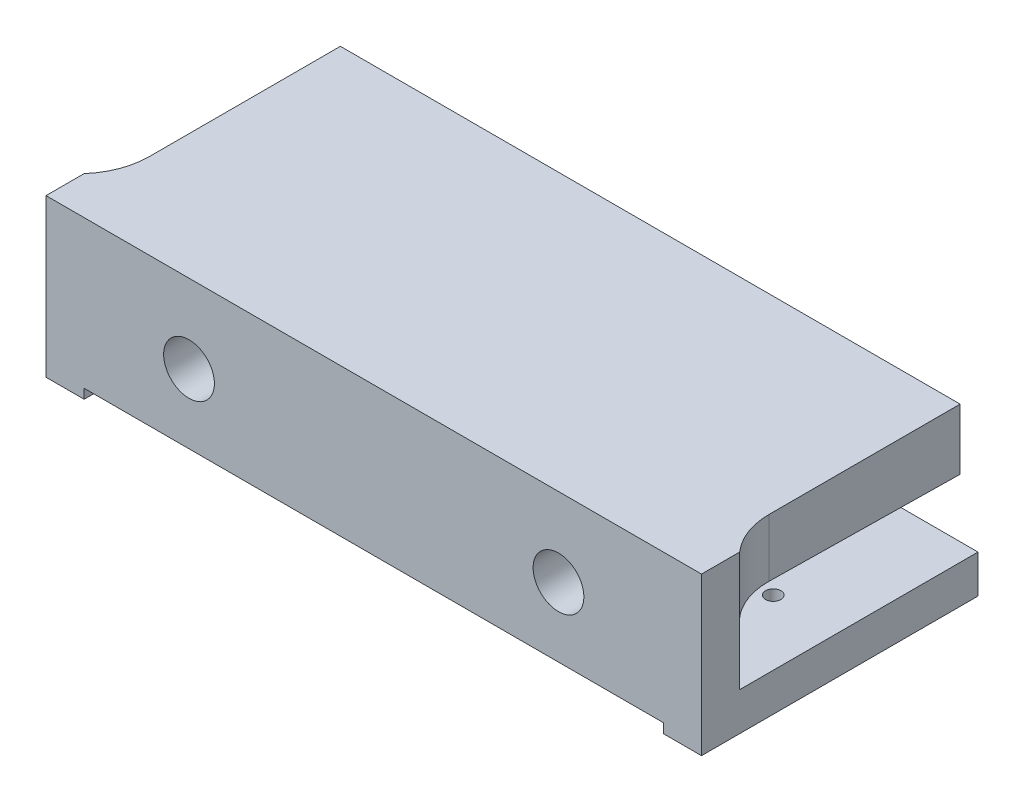
ISO-10303-21;
HEADER;
FILE_DESCRIPTION(('STEP AP214'),'2;1');
FILE_NAME('part.step','',(''),(''),'','','');
FILE_SCHEMA(('AUTOMOTIVE_DESIGN { 1 0 10303 214 1 1 1 1 }'));
ENDSEC;
DATA;
#1=APPLICATION_CONTEXT('core data for automotive mechanical design processes');
#2=APPLICATION_PROTOCOL_DEFINITION('international standard','automotive_design',2000,#1);
#3=PRODUCT_CONTEXT('',#1,'mechanical');
#4=PRODUCT('Part','Part','',(#3));
#5=PRODUCT_RELATED_PRODUCT_CATEGORY('part','',(#4));
#6=PRODUCT_DEFINITION_FORMATION('','',#4);
#7=PRODUCT_DEFINITION_CONTEXT('part definition',#1,'design');
#8=PRODUCT_DEFINITION('design','',#6,#7);
#9=PRODUCT_DEFINITION_SHAPE('','',#8);
#10=(LENGTH_UNIT() NAMED_UNIT(*) SI_UNIT(.MILLI.,.METRE.));
#11=(NAMED_UNIT(*) PLANE_ANGLE_UNIT() SI_UNIT($,.RADIAN.));
#12=(NAMED_UNIT(*) SI_UNIT($,.STERADIAN.) SOLID_ANGLE_UNIT());
#13=UNCERTAINTY_MEASURE_WITH_UNIT(LENGTH_MEASURE(1.E-05),#10,'distance_accuracy_value','');
#14=(GEOMETRIC_REPRESENTATION_CONTEXT(3) GLOBAL_UNCERTAINTY_ASSIGNED_CONTEXT((#13)) GLOBAL_UNIT_ASSIGNED_CONTEXT((#10,
#11,#12)) REPRESENTATION_CONTEXT('',''));
#15=CARTESIAN_POINT('',(0.,0.,0.));
#16=DIRECTION('',(0.,0.,1.));
#17=DIRECTION('',(1.,0.,0.));
#18=AXIS2_PLACEMENT_3D('',#15,#16,#17);
#19=CARTESIAN_POINT('',(0.,0.,-14.732));
#20=DIRECTION('',(0.,0.,1.));
#21=DIRECTION('',(1.,0.,0.));
#22=AXIS2_PLACEMENT_3D('',#19,#20,#21);
#23=PLANE('',#22);
#24=DIRECTION('',(0.,-1.,0.));
#25=VECTOR('',#24,1.);
#26=CARTESIAN_POINT('',(33.02,0.,-14.732));
#27=LINE('',#26,#25);
#28=CARTESIAN_POINT('',(33.02,16.764,-14.732));
#29=VERTEX_POINT('',#28);
#30=CARTESIAN_POINT('',(33.02,10.287,-14.732));
#31=VERTEX_POINT('',#30);
#32=EDGE_CURVE('E297',#29,#31,#27,.T.);
#33=ORIENTED_EDGE('',*,*,#32,.T.);
#34=DIRECTION('',(-1.,0.,0.));
#35=VECTOR('',#34,1.);
#36=CARTESIAN_POINT('',(34.925,10.287,-14.732));
#37=LINE('',#36,#35);
#38=CARTESIAN_POINT('',(-33.02,10.287,-14.732));
#39=VERTEX_POINT('',#38);
#40=EDGE_CURVE('E190',#31,#39,#37,.T.);
#41=ORIENTED_EDGE('',*,*,#40,.T.);
#42=DIRECTION('',(0.,-1.,0.));
#43=VECTOR('',#42,1.);
#44=CARTESIAN_POINT('',(-33.02,0.,-14.732));
#45=LINE('',#44,#43);
#46=CARTESIAN_POINT('',(-33.02,16.764,-14.732));
#47=VERTEX_POINT('',#46);
#48=EDGE_CURVE('E293',#47,#39,#45,.T.);
#49=ORIENTED_EDGE('',*,*,#48,.F.);
#50=DIRECTION('',(1.,0.,0.));
#51=VECTOR('',#50,1.);
#52=CARTESIAN_POINT('',(34.925,16.764,-14.732));
#53=LINE('',#52,#51);
#54=EDGE_CURVE('E205',#47,#29,#53,.T.);
#55=ORIENTED_EDGE('',*,*,#54,.T.);
#56=EDGE_LOOP('',(#33,#41,#49,#55));
#57=FACE_BOUND('',#56,.T.);
#58=ADVANCED_FACE('F37',(#57),#23,.F.);
#59=CARTESIAN_POINT('',(34.925,10.287,-14.732));
#60=DIRECTION('',(0.,0.999887518980816,-0.0149983127847122));
#61=DIRECTION('',(0.,0.0149983127847122,0.999887518980816));
#62=AXIS2_PLACEMENT_3D('',#59,#60,#61);
#63=PLANE('',#62);
#64=DIRECTION('',(0.,-0.0149983127847122,-0.999887518980816));
#65=VECTOR('',#64,1.);
#66=CARTESIAN_POINT('',(33.02,10.287,-14.732));
#67=LINE('',#66,#65);
#68=CARTESIAN_POINT('',(33.02,10.5923976562863,5.62784375242197));
#69=VERTEX_POINT('',#68);
#70=EDGE_CURVE('E179',#69,#31,#67,.T.);
#71=ORIENTED_EDGE('',*,*,#70,.F.);
#72=CARTESIAN_POINT('',(40.64,10.5923976562863,5.62784375242197));
#73=DIRECTION('',(0.,0.999887518980816,-0.0149983127847122));
#74=DIRECTION('',(0.,-0.0149983127847122,-0.999887518980816));
#75=AXIS2_PLACEMENT_3D('',#72,#73,#74);
#76=ELLIPSE('',#75,7.62085720178511,7.62);
#77=CARTESIAN_POINT('',(34.925,10.668,10.668));
#78=VERTEX_POINT('',#77);
#79=EDGE_CURVE('E45',#69,#78,#76,.T.);
#80=ORIENTED_EDGE('',*,*,#79,.T.);
#81=DIRECTION('',(-1.,0.,0.));
#82=VECTOR('',#81,1.);
#83=CARTESIAN_POINT('',(34.925,10.668,10.668));
#84=LINE('',#83,#82);
#85=CARTESIAN_POINT('',(21.131295270683,10.668,10.668));
#86=VERTEX_POINT('',#85);
#87=EDGE_CURVE('E186',#78,#86,#84,.T.);
#88=ORIENTED_EDGE('',*,*,#87,.T.);
#89=CARTESIAN_POINT('',(18.238704729317,10.668,10.668));
#90=VERTEX_POINT('',#89);
#91=EDGE_CURVE('E275',#86,#90,#84,.T.);
#92=ORIENTED_EDGE('',*,*,#91,.T.);
#93=CARTESIAN_POINT('',(-18.238704729317,10.668,10.668));
#94=VERTEX_POINT('',#93);
#95=EDGE_CURVE('E306',#90,#94,#84,.T.);
#96=ORIENTED_EDGE('',*,*,#95,.T.);
#97=CARTESIAN_POINT('',(-21.131295270683,10.668,10.668));
#98=VERTEX_POINT('',#97);
#99=EDGE_CURVE('E313',#94,#98,#84,.T.);
#100=ORIENTED_EDGE('',*,*,#99,.T.);
#101=CARTESIAN_POINT('',(-34.925,10.668,10.668));
#102=VERTEX_POINT('',#101);
#103=EDGE_CURVE('E276',#98,#102,#84,.T.);
#104=ORIENTED_EDGE('',*,*,#103,.T.);
#105=CARTESIAN_POINT('',(-40.64,10.5923976562863,5.62784375242197));
#106=DIRECTION('',(0.,0.999887518980816,-0.0149983127847122));
#107=DIRECTION('',(0.,0.0149983127847122,0.999887518980816));
#108=AXIS2_PLACEMENT_3D('',#105,#106,#107);
#109=ELLIPSE('',#108,7.62085720178511,7.62);
#110=CARTESIAN_POINT('',(-33.02,10.5923976562863,5.62784375242197));
#111=VERTEX_POINT('',#110);
#112=EDGE_CURVE('E174',#102,#111,#109,.T.);
#113=ORIENTED_EDGE('',*,*,#112,.T.);
#114=DIRECTION('',(0.,-0.0149983127847122,-0.999887518980816));
#115=VECTOR('',#114,1.);
#116=CARTESIAN_POINT('',(-33.02,10.287,-14.732));
#117=LINE('',#116,#115);
#118=EDGE_CURVE('E193',#111,#39,#117,.T.);
#119=ORIENTED_EDGE('',*,*,#118,.T.);
#120=ORIENTED_EDGE('',*,*,#40,.F.);
#121=EDGE_LOOP('',(#71,#80,#88,#92,#96,#100,#104,#113,#119,#120));
#122=FACE_BOUND('',#121,.T.);
#123=ADVANCED_FACE('F184',(#122),#63,.F.);
#124=CARTESIAN_POINT('',(61.1067207226721,10.414,10.668));
#125=DIRECTION('',(0.,0.,1.));
#126=DIRECTION('',(1.,0.,0.));
#127=AXIS2_PLACEMENT_3D('',#124,#125,#126);
#128=PLANE('',#127);
#129=DIRECTION('',(0.,1.,0.));
#130=VECTOR('',#129,1.);
#131=CARTESIAN_POINT('',(-34.925,10.414,10.668));
#132=LINE('',#131,#130);
#133=CARTESIAN_POINT('',(-34.925,4.064,10.668));
#134=VERTEX_POINT('',#133);
#135=EDGE_CURVE('E231',#134,#102,#132,.T.);
#136=ORIENTED_EDGE('',*,*,#135,.T.);
#137=ORIENTED_EDGE('',*,*,#103,.F.);
#138=CARTESIAN_POINT('',(-19.685,8.38200000000001,10.668));
#139=DIRECTION('',(0.,0.,1.));
#140=DIRECTION('',(1.,0.,0.));
#141=AXIS2_PLACEMENT_3D('',#138,#139,#140);
#142=CIRCLE('',#141,2.7051);
#143=EDGE_CURVE('E287',#98,#94,#142,.T.);
#144=ORIENTED_EDGE('',*,*,#143,.T.);
#145=ORIENTED_EDGE('',*,*,#95,.F.);
#146=CARTESIAN_POINT('',(19.685,8.38200000000001,10.668));
#147=DIRECTION('',(0.,0.,1.));
#148=DIRECTION('',(1.,0.,0.));
#149=AXIS2_PLACEMENT_3D('',#146,#147,#148);
#150=CIRCLE('',#149,2.7051);
#151=EDGE_CURVE('E281',#90,#86,#150,.T.);
#152=ORIENTED_EDGE('',*,*,#151,.T.);
#153=ORIENTED_EDGE('',*,*,#87,.F.);
#154=DIRECTION('',(0.,-1.,0.));
#155=VECTOR('',#154,1.);
#156=CARTESIAN_POINT('',(34.925,10.414,10.668));
#157=LINE('',#156,#155);
#158=CARTESIAN_POINT('',(34.925,4.064,10.668));
#159=VERTEX_POINT('',#158);
#160=EDGE_CURVE('E161',#78,#159,#157,.T.);
#161=ORIENTED_EDGE('',*,*,#160,.T.);
#162=DIRECTION('',(-1.,0.,0.));
#163=VECTOR('',#162,1.);
#164=CARTESIAN_POINT('',(61.1067207226721,4.064,10.668));
#165=LINE('',#164,#163);
#166=EDGE_CURVE('E230',#159,#134,#165,.T.);
#167=ORIENTED_EDGE('',*,*,#166,.T.);
#168=EDGE_LOOP('',(#136,#137,#144,#145,#152,#153,#161,#167));
#169=FACE_BOUND('',#168,.T.);
#170=ADVANCED_FACE('F303',(#169),#128,.F.);
#171=CARTESIAN_POINT('',(-34.925,16.764,14.732));
#172=DIRECTION('',(0.,0.,-1.));
#173=DIRECTION('',(-1.,0.,0.));
#174=AXIS2_PLACEMENT_3D('',#171,#172,#173);
#175=PLANE('',#174);
#176=CARTESIAN_POINT('',(-19.685,8.38200000000001,14.732));
#177=DIRECTION('',(0.,0.,1.));
#178=DIRECTION('',(1.,0.,0.));
#179=AXIS2_PLACEMENT_3D('',#176,#177,#178);
#180=CIRCLE('',#179,2.7051);
#181=CARTESIAN_POINT('',(-16.9799,8.38200000000001,14.732));
#182=VERTEX_POINT('',#181);
#183=EDGE_CURVE('E284',#182,#182,#180,.T.);
#184=ORIENTED_EDGE('',*,*,#183,.F.);
#185=EDGE_LOOP('',(#184));
#186=FACE_BOUND('',#185,.T.);
#187=CARTESIAN_POINT('',(19.685,8.38200000000001,14.732));
#188=DIRECTION('',(0.,0.,1.));
#189=DIRECTION('',(1.,0.,0.));
#190=AXIS2_PLACEMENT_3D('',#187,#188,#189);
#191=CIRCLE('',#190,2.7051);
#192=CARTESIAN_POINT('',(22.3901,8.38200000000001,14.732));
#193=VERTEX_POINT('',#192);
#194=EDGE_CURVE('E280',#193,#193,#191,.T.);
#195=ORIENTED_EDGE('',*,*,#194,.F.);
#196=EDGE_LOOP('',(#195));
#197=FACE_BOUND('',#196,.T.);
#198=DIRECTION('',(0.,-1.,0.));
#199=VECTOR('',#198,1.);
#200=CARTESIAN_POINT('',(30.861,1.016,14.732));
#201=LINE('',#200,#199);
#202=CARTESIAN_POINT('',(30.861,1.016,14.732));
#203=VERTEX_POINT('',#202);
#204=CARTESIAN_POINT('',(30.861,0.,14.732));
#205=VERTEX_POINT('',#204);
#206=EDGE_CURVE('E240',#203,#205,#201,.T.);
#207=ORIENTED_EDGE('',*,*,#206,.T.);
#208=DIRECTION('',(1.,0.,0.));
#209=VECTOR('',#208,1.);
#210=CARTESIAN_POINT('',(-34.925,0.,14.732));
#211=LINE('',#210,#209);
#212=CARTESIAN_POINT('',(34.925,0.,14.732));
#213=VERTEX_POINT('',#212);
#214=EDGE_CURVE('E216',#205,#213,#211,.T.);
#215=ORIENTED_EDGE('',*,*,#214,.T.);
#216=DIRECTION('',(0.,-1.,0.));
#217=VECTOR('',#216,1.);
#218=CARTESIAN_POINT('',(34.925,16.764,14.732));
#219=LINE('',#218,#217);
#220=CARTESIAN_POINT('',(34.925,16.764,14.732));
#221=VERTEX_POINT('',#220);
#222=EDGE_CURVE('E212',#221,#213,#219,.T.);
#223=ORIENTED_EDGE('',*,*,#222,.F.);
#224=DIRECTION('',(1.,0.,0.));
#225=VECTOR('',#224,1.);
#226=CARTESIAN_POINT('',(-34.925,16.764,14.732));
#227=LINE('',#226,#225);
#228=CARTESIAN_POINT('',(-34.925,16.764,14.732));
#229=VERTEX_POINT('',#228);
#230=EDGE_CURVE('E166',#229,#221,#227,.T.);
#231=ORIENTED_EDGE('',*,*,#230,.F.);
#232=DIRECTION('',(0.,-1.,0.));
#233=VECTOR('',#232,1.);
#234=CARTESIAN_POINT('',(-34.925,16.764,14.732));
#235=LINE('',#234,#233);
#236=CARTESIAN_POINT('',(-34.925,0.,14.732));
#237=VERTEX_POINT('',#236);
#238=EDGE_CURVE('E209',#229,#237,#235,.T.);
#239=ORIENTED_EDGE('',*,*,#238,.T.);
#240=CARTESIAN_POINT('',(-30.861,0.,14.732));
#241=VERTEX_POINT('',#240);
#242=EDGE_CURVE('E169',#237,#241,#211,.T.);
#243=ORIENTED_EDGE('',*,*,#242,.T.);
#244=DIRECTION('',(0.,-1.,0.));
#245=VECTOR('',#244,1.);
#246=CARTESIAN_POINT('',(-30.861,1.016,14.732));
#247=LINE('',#246,#245);
#248=CARTESIAN_POINT('',(-30.861,1.016,14.732));
#249=VERTEX_POINT('',#248);
#250=EDGE_CURVE('E243',#249,#241,#247,.T.);
#251=ORIENTED_EDGE('',*,*,#250,.F.);
#252=DIRECTION('',(-1.,0.,0.));
#253=VECTOR('',#252,1.);
#254=CARTESIAN_POINT('',(0.,1.016,14.732));
#255=LINE('',#254,#253);
#256=EDGE_CURVE('E264',#203,#249,#255,.T.);
#257=ORIENTED_EDGE('',*,*,#256,.F.);
#258=EDGE_LOOP('',(#207,#215,#223,#231,#239,#243,#251,#257));
#259=FACE_BOUND('',#258,.T.);
#260=ADVANCED_FACE('F347',(#186,#197,#259),#175,.F.);
#261=CARTESIAN_POINT('',(0.,0.,0.));
#262=DIRECTION('',(0.,-1.,0.));
#263=DIRECTION('',(0.,0.,-1.));
#264=AXIS2_PLACEMENT_3D('',#261,#262,#263);
#265=PLANE('',#264);
#266=ORIENTED_EDGE('',*,*,#214,.F.);
#267=DIRECTION('',(0.,0.,-1.));
#268=VECTOR('',#267,1.);
#269=CARTESIAN_POINT('',(30.861,0.,0.));
#270=LINE('',#269,#268);
#271=CARTESIAN_POINT('',(30.861,0.,-2.3876));
#272=VERTEX_POINT('',#271);
#273=EDGE_CURVE('E256',#205,#272,#270,.T.);
#274=ORIENTED_EDGE('',*,*,#273,.T.);
#275=DIRECTION('',(1.,0.,0.));
#276=VECTOR('',#275,1.);
#277=CARTESIAN_POINT('',(0.,0.,-2.3876));
#278=LINE('',#277,#276);
#279=CARTESIAN_POINT('',(-30.861,0.,-2.3876));
#280=VERTEX_POINT('',#279);
#281=EDGE_CURVE('E249',#280,#272,#278,.T.);
#282=ORIENTED_EDGE('',*,*,#281,.F.);
#283=DIRECTION('',(0.,0.,-1.));
#284=VECTOR('',#283,1.);
#285=CARTESIAN_POINT('',(-30.861,0.,0.));
#286=LINE('',#285,#284);
#287=EDGE_CURVE('E253',#241,#280,#286,.T.);
#288=ORIENTED_EDGE('',*,*,#287,.F.);
#289=ORIENTED_EDGE('',*,*,#242,.F.);
#290=DIRECTION('',(0.,0.,1.));
#291=VECTOR('',#290,1.);
#292=CARTESIAN_POINT('',(-34.925,0.,14.732));
#293=LINE('',#292,#291);
#294=CARTESIAN_POINT('',(-34.925,0.,-14.732));
#295=VERTEX_POINT('',#294);
#296=EDGE_CURVE('E217',#295,#237,#293,.T.);
#297=ORIENTED_EDGE('',*,*,#296,.F.);
#298=DIRECTION('',(-1.,0.,0.));
#299=VECTOR('',#298,1.);
#300=CARTESIAN_POINT('',(-34.925,0.,-14.732));
#301=LINE('',#300,#299);
#302=CARTESIAN_POINT('',(34.925,0.,-14.732));
#303=VERTEX_POINT('',#302);
#304=EDGE_CURVE('E219',#303,#295,#301,.T.);
#305=ORIENTED_EDGE('',*,*,#304,.F.);
#306=DIRECTION('',(0.,0.,-1.));
#307=VECTOR('',#306,1.);
#308=CARTESIAN_POINT('',(34.925,0.,14.732));
#309=LINE('',#308,#307);
#310=EDGE_CURVE('E222',#213,#303,#309,.T.);
#311=ORIENTED_EDGE('',*,*,#310,.F.);
#312=EDGE_LOOP('',(#266,#274,#282,#288,#289,#297,#305,#311));
#313=FACE_BOUND('',#312,.T.);
#314=ADVANCED_FACE('F344',(#313),#265,.T.);
#315=CARTESIAN_POINT('',(34.925,16.764,14.732));
#316=DIRECTION('',(-1.,0.,0.));
#317=DIRECTION('',(0.,0.,1.));
#318=AXIS2_PLACEMENT_3D('',#315,#316,#317);
#319=PLANE('',#318);
#320=CARTESIAN_POINT('',(34.925,16.764,10.668));
#321=VERTEX_POINT('',#320);
#322=EDGE_CURVE('E156',#321,#78,#157,.T.);
#323=ORIENTED_EDGE('',*,*,#322,.F.);
#324=DIRECTION('',(0.,0.,-1.));
#325=VECTOR('',#324,1.);
#326=CARTESIAN_POINT('',(34.925,16.764,14.732));
#327=LINE('',#326,#325);
#328=EDGE_CURVE('E159',#221,#321,#327,.T.);
#329=ORIENTED_EDGE('',*,*,#328,.F.);
#330=ORIENTED_EDGE('',*,*,#222,.T.);
#331=ORIENTED_EDGE('',*,*,#310,.T.);
#332=DIRECTION('',(0.,-1.,0.));
#333=VECTOR('',#332,1.);
#334=CARTESIAN_POINT('',(34.925,16.764,-14.732));
#335=LINE('',#334,#333);
#336=CARTESIAN_POINT('',(34.925,4.064,-14.732));
#337=VERTEX_POINT('',#336);
#338=EDGE_CURVE('E194',#337,#303,#335,.T.);
#339=ORIENTED_EDGE('',*,*,#338,.F.);
#340=DIRECTION('',(0.,0.,-1.));
#341=VECTOR('',#340,1.);
#342=CARTESIAN_POINT('',(34.925,4.064,-14.732));
#343=LINE('',#342,#341);
#344=EDGE_CURVE('E162',#159,#337,#343,.T.);
#345=ORIENTED_EDGE('',*,*,#344,.F.);
#346=ORIENTED_EDGE('',*,*,#160,.F.);
#347=EDGE_LOOP('',(#323,#329,#330,#331,#339,#345,#346));
#348=FACE_BOUND('',#347,.T.);
#349=ADVANCED_FACE('F157',(#348),#319,.F.);
#350=CARTESIAN_POINT('',(0.,16.764,0.));
#351=DIRECTION('',(0.,-1.,0.));
#352=DIRECTION('',(0.,0.,-1.));
#353=AXIS2_PLACEMENT_3D('',#350,#351,#352);
#354=PLANE('',#353);
#355=ORIENTED_EDGE('',*,*,#328,.T.);
#356=CARTESIAN_POINT('',(40.64,16.764,5.62784375242197));
#357=DIRECTION('',(0.,-1.,0.));
#358=DIRECTION('',(0.,0.,-1.));
#359=AXIS2_PLACEMENT_3D('',#356,#357,#358);
#360=CIRCLE('',#359,7.62);
#361=CARTESIAN_POINT('',(33.02,16.764,5.62784375242197));
#362=VERTEX_POINT('',#361);
#363=EDGE_CURVE('E11',#321,#362,#360,.T.);
#364=ORIENTED_EDGE('',*,*,#363,.T.);
#365=DIRECTION('',(0.,0.,-1.));
#366=VECTOR('',#365,1.);
#367=CARTESIAN_POINT('',(33.02,16.764,17.419337200881));
#368=LINE('',#367,#366);
#369=EDGE_CURVE('E292',#362,#29,#368,.T.);
#370=ORIENTED_EDGE('',*,*,#369,.T.);
#371=ORIENTED_EDGE('',*,*,#54,.F.);
#372=DIRECTION('',(0.,0.,-1.));
#373=VECTOR('',#372,1.);
#374=CARTESIAN_POINT('',(-33.02,16.764,17.419337200881));
#375=LINE('',#374,#373);
#376=CARTESIAN_POINT('',(-33.02,16.764,5.62784375242197));
#377=VERTEX_POINT('',#376);
#378=EDGE_CURVE('E290',#377,#47,#375,.T.);
#379=ORIENTED_EDGE('',*,*,#378,.F.);
#380=CARTESIAN_POINT('',(-40.64,16.764,5.62784375242197));
#381=DIRECTION('',(0.,-1.,0.));
#382=DIRECTION('',(0.,0.,-1.));
#383=AXIS2_PLACEMENT_3D('',#380,#381,#382);
#384=CIRCLE('',#383,7.62);
#385=CARTESIAN_POINT('',(-34.925,16.764,10.668));
#386=VERTEX_POINT('',#385);
#387=EDGE_CURVE('E177',#377,#386,#384,.T.);
#388=ORIENTED_EDGE('',*,*,#387,.T.);
#389=DIRECTION('',(0.,0.,1.));
#390=VECTOR('',#389,1.);
#391=CARTESIAN_POINT('',(-34.925,16.764,14.732));
#392=LINE('',#391,#390);
#393=EDGE_CURVE('E168',#386,#229,#392,.T.);
#394=ORIENTED_EDGE('',*,*,#393,.T.);
#395=ORIENTED_EDGE('',*,*,#230,.T.);
#396=EDGE_LOOP('',(#355,#364,#370,#371,#379,#388,#394,#395));
#397=FACE_BOUND('',#396,.T.);
#398=ADVANCED_FACE('F164',(#397),#354,.F.);
#399=CARTESIAN_POINT('',(-34.925,16.764,-14.732));
#400=DIRECTION('',(0.,0.,1.));
#401=DIRECTION('',(1.,0.,0.));
#402=AXIS2_PLACEMENT_3D('',#399,#400,#401);
#403=PLANE('',#402);
#404=DIRECTION('',(0.,-1.,0.));
#405=VECTOR('',#404,1.);
#406=CARTESIAN_POINT('',(-34.925,16.764,-14.732));
#407=LINE('',#406,#405);
#408=CARTESIAN_POINT('',(-34.925,4.064,-14.732));
#409=VERTEX_POINT('',#408);
#410=EDGE_CURVE('E207',#409,#295,#407,.T.);
#411=ORIENTED_EDGE('',*,*,#410,.F.);
#412=DIRECTION('',(-1.,0.,0.));
#413=VECTOR('',#412,1.);
#414=CARTESIAN_POINT('',(61.1067207226721,4.064,-14.732));
#415=LINE('',#414,#413);
#416=EDGE_CURVE('E228',#337,#409,#415,.T.);
#417=ORIENTED_EDGE('',*,*,#416,.F.);
#418=ORIENTED_EDGE('',*,*,#338,.T.);
#419=ORIENTED_EDGE('',*,*,#304,.T.);
#420=EDGE_LOOP('',(#411,#417,#418,#419));
#421=FACE_BOUND('',#420,.T.);
#422=ADVANCED_FACE('F336',(#421),#403,.F.);
#423=CARTESIAN_POINT('',(-34.925,16.764,14.732));
#424=DIRECTION('',(1.,0.,0.));
#425=DIRECTION('',(0.,0.,-1.));
#426=AXIS2_PLACEMENT_3D('',#423,#424,#425);
#427=PLANE('',#426);
#428=ORIENTED_EDGE('',*,*,#393,.F.);
#429=EDGE_CURVE('E235',#102,#386,#132,.T.);
#430=ORIENTED_EDGE('',*,*,#429,.F.);
#431=ORIENTED_EDGE('',*,*,#135,.F.);
#432=DIRECTION('',(0.,0.,1.));
#433=VECTOR('',#432,1.);
#434=CARTESIAN_POINT('',(-34.925,4.064,-14.732));
#435=LINE('',#434,#433);
#436=EDGE_CURVE('E236',#409,#134,#435,.T.);
#437=ORIENTED_EDGE('',*,*,#436,.F.);
#438=ORIENTED_EDGE('',*,*,#410,.T.);
#439=ORIENTED_EDGE('',*,*,#296,.T.);
#440=ORIENTED_EDGE('',*,*,#238,.F.);
#441=EDGE_LOOP('',(#428,#430,#431,#437,#438,#439,#440));
#442=FACE_BOUND('',#441,.T.);
#443=ADVANCED_FACE('F327',(#442),#427,.F.);
#444=CARTESIAN_POINT('',(61.1067207226721,4.064,-14.732));
#445=DIRECTION('',(0.,-1.,0.));
#446=DIRECTION('',(0.,0.,-1.));
#447=AXIS2_PLACEMENT_3D('',#444,#445,#446);
#448=PLANE('',#447);
#449=CARTESIAN_POINT('',(-27.9908,4.064,0.152399999999998));
#450=DIRECTION('',(0.,-1.,0.));
#451=DIRECTION('',(0.,0.,-1.));
#452=AXIS2_PLACEMENT_3D('',#449,#450,#451);
#453=CIRCLE('',#452,0.819150000000002);
#454=CARTESIAN_POINT('',(-27.9908,4.064,-0.666750000000004));
#455=VERTEX_POINT('',#454);
#456=EDGE_CURVE('E200',#455,#455,#453,.T.);
#457=ORIENTED_EDGE('',*,*,#456,.T.);
#458=EDGE_LOOP('',(#457));
#459=FACE_BOUND('',#458,.T.);
#460=CARTESIAN_POINT('',(27.9908,4.064,0.152400000000009));
#461=DIRECTION('',(0.,-1.,0.));
#462=DIRECTION('',(0.,0.,-1.));
#463=AXIS2_PLACEMENT_3D('',#460,#461,#462);
#464=CIRCLE('',#463,0.819150000000002);
#465=CARTESIAN_POINT('',(27.9908,4.064,-0.666749999999994));
#466=VERTEX_POINT('',#465);
#467=EDGE_CURVE('E201',#466,#466,#464,.T.);
#468=ORIENTED_EDGE('',*,*,#467,.T.);
#469=EDGE_LOOP('',(#468));
#470=FACE_BOUND('',#469,.T.);
#471=ORIENTED_EDGE('',*,*,#344,.T.);
#472=ORIENTED_EDGE('',*,*,#416,.T.);
#473=ORIENTED_EDGE('',*,*,#436,.T.);
#474=ORIENTED_EDGE('',*,*,#166,.F.);
#475=EDGE_LOOP('',(#471,#472,#473,#474));
#476=FACE_BOUND('',#475,.T.);
#477=ADVANCED_FACE('F332',(#459,#470,#476),#448,.F.);
#478=CARTESIAN_POINT('',(30.861,1.016,0.));
#479=DIRECTION('',(-1.,0.,0.));
#480=DIRECTION('',(0.,0.,1.));
#481=AXIS2_PLACEMENT_3D('',#478,#479,#480);
#482=PLANE('',#481);
#483=ORIENTED_EDGE('',*,*,#273,.F.);
#484=ORIENTED_EDGE('',*,*,#206,.F.);
#485=DIRECTION('',(0.,0.,-1.));
#486=VECTOR('',#485,1.);
#487=CARTESIAN_POINT('',(30.861,1.016,0.));
#488=LINE('',#487,#486);
#489=CARTESIAN_POINT('',(30.861,1.016,-2.3876));
#490=VERTEX_POINT('',#489);
#491=EDGE_CURVE('E252',#203,#490,#488,.T.);
#492=ORIENTED_EDGE('',*,*,#491,.T.);
#493=DIRECTION('',(0.,-1.,0.));
#494=VECTOR('',#493,1.);
#495=CARTESIAN_POINT('',(30.861,1.016,-2.3876));
#496=LINE('',#495,#494);
#497=EDGE_CURVE('E238',#490,#272,#496,.T.);
#498=ORIENTED_EDGE('',*,*,#497,.T.);
#499=EDGE_LOOP('',(#483,#484,#492,#498));
#500=FACE_BOUND('',#499,.T.);
#501=ADVANCED_FACE('F351',(#500),#482,.T.);
#502=CARTESIAN_POINT('',(0.,1.016,-2.3876));
#503=DIRECTION('',(0.,0.,-1.));
#504=DIRECTION('',(-1.,0.,0.));
#505=AXIS2_PLACEMENT_3D('',#502,#503,#504);
#506=PLANE('',#505);
#507=ORIENTED_EDGE('',*,*,#281,.T.);
#508=ORIENTED_EDGE('',*,*,#497,.F.);
#509=DIRECTION('',(1.,0.,0.));
#510=VECTOR('',#509,1.);
#511=CARTESIAN_POINT('',(0.,1.016,-2.3876));
#512=LINE('',#511,#510);
#513=CARTESIAN_POINT('',(-30.861,1.016,-2.3876));
#514=VERTEX_POINT('',#513);
#515=EDGE_CURVE('E244',#514,#490,#512,.T.);
#516=ORIENTED_EDGE('',*,*,#515,.F.);
#517=DIRECTION('',(0.,-1.,0.));
#518=VECTOR('',#517,1.);
#519=CARTESIAN_POINT('',(-30.861,1.016,-2.3876));
#520=LINE('',#519,#518);
#521=EDGE_CURVE('E246',#514,#280,#520,.T.);
#522=ORIENTED_EDGE('',*,*,#521,.T.);
#523=EDGE_LOOP('',(#507,#508,#516,#522));
#524=FACE_BOUND('',#523,.T.);
#525=ADVANCED_FACE('F359',(#524),#506,.F.);
#526=CARTESIAN_POINT('',(-30.861,1.016,0.));
#527=DIRECTION('',(-1.,0.,0.));
#528=DIRECTION('',(0.,0.,1.));
#529=AXIS2_PLACEMENT_3D('',#526,#527,#528);
#530=PLANE('',#529);
#531=ORIENTED_EDGE('',*,*,#287,.T.);
#532=ORIENTED_EDGE('',*,*,#521,.F.);
#533=DIRECTION('',(0.,0.,-1.));
#534=VECTOR('',#533,1.);
#535=CARTESIAN_POINT('',(-30.861,1.016,0.));
#536=LINE('',#535,#534);
#537=EDGE_CURVE('E261',#249,#514,#536,.T.);
#538=ORIENTED_EDGE('',*,*,#537,.F.);
#539=ORIENTED_EDGE('',*,*,#250,.T.);
#540=EDGE_LOOP('',(#531,#532,#538,#539));
#541=FACE_BOUND('',#540,.T.);
#542=ADVANCED_FACE('F361',(#541),#530,.F.);
#543=CARTESIAN_POINT('',(0.,1.016,0.));
#544=DIRECTION('',(0.,-1.,0.));
#545=DIRECTION('',(0.,0.,-1.));
#546=AXIS2_PLACEMENT_3D('',#543,#544,#545);
#547=PLANE('',#546);
#548=CARTESIAN_POINT('',(-27.9908,1.016,0.152399999999998));
#549=DIRECTION('',(0.,-1.,0.));
#550=DIRECTION('',(0.,0.,-1.));
#551=AXIS2_PLACEMENT_3D('',#548,#549,#550);
#552=CIRCLE('',#551,0.819150000000002);
#553=CARTESIAN_POINT('',(-27.9908,1.016,-0.666750000000004));
#554=VERTEX_POINT('',#553);
#555=EDGE_CURVE('E197',#554,#554,#552,.T.);
#556=ORIENTED_EDGE('',*,*,#555,.F.);
#557=EDGE_LOOP('',(#556));
#558=FACE_BOUND('',#557,.T.);
#559=CARTESIAN_POINT('',(27.9908,1.016,0.152400000000009));
#560=DIRECTION('',(0.,-1.,0.));
#561=DIRECTION('',(0.,0.,-1.));
#562=AXIS2_PLACEMENT_3D('',#559,#560,#561);
#563=CIRCLE('',#562,0.819150000000002);
#564=CARTESIAN_POINT('',(27.9908,1.016,-0.666749999999994));
#565=VERTEX_POINT('',#564);
#566=EDGE_CURVE('E202',#565,#565,#563,.T.);
#567=ORIENTED_EDGE('',*,*,#566,.F.);
#568=EDGE_LOOP('',(#567));
#569=FACE_BOUND('',#568,.T.);
#570=ORIENTED_EDGE('',*,*,#491,.F.);
#571=ORIENTED_EDGE('',*,*,#256,.T.);
#572=ORIENTED_EDGE('',*,*,#537,.T.);
#573=ORIENTED_EDGE('',*,*,#515,.T.);
#574=EDGE_LOOP('',(#570,#571,#572,#573));
#575=FACE_BOUND('',#574,.T.);
#576=ADVANCED_FACE('F356',(#558,#569,#575),#547,.T.);
#577=CARTESIAN_POINT('',(27.9908,16.764,0.152400000000009));
#578=DIRECTION('',(0.,-1.,0.));
#579=DIRECTION('',(0.,0.,-1.));
#580=AXIS2_PLACEMENT_3D('',#577,#578,#579);
#581=CYLINDRICAL_SURFACE('',#580,0.819150000000002);
#582=ORIENTED_EDGE('',*,*,#566,.T.);
#583=EDGE_LOOP('',(#582));
#584=FACE_BOUND('',#583,.T.);
#585=ORIENTED_EDGE('',*,*,#467,.F.);
#586=EDGE_LOOP('',(#585));
#587=FACE_BOUND('',#586,.T.);
#588=ADVANCED_FACE('F368',(#584,#587),#581,.F.);
#589=CARTESIAN_POINT('',(-27.9908,16.764,0.152399999999998));
#590=DIRECTION('',(0.,-1.,0.));
#591=DIRECTION('',(0.,0.,-1.));
#592=AXIS2_PLACEMENT_3D('',#589,#590,#591);
#593=CYLINDRICAL_SURFACE('',#592,0.819150000000002);
#594=ORIENTED_EDGE('',*,*,#555,.T.);
#595=EDGE_LOOP('',(#594));
#596=FACE_BOUND('',#595,.T.);
#597=ORIENTED_EDGE('',*,*,#456,.F.);
#598=EDGE_LOOP('',(#597));
#599=FACE_BOUND('',#598,.T.);
#600=ADVANCED_FACE('F381',(#596,#599),#593,.F.);
#601=CARTESIAN_POINT('',(19.685,8.38200000000001,10.668));
#602=DIRECTION('',(0.,0.,1.));
#603=DIRECTION('',(1.,0.,0.));
#604=AXIS2_PLACEMENT_3D('',#601,#602,#603);
#605=PLANE('',#604);
#606=ORIENTED_EDGE('',*,*,#91,.F.);
#607=EDGE_CURVE('E278',#86,#90,#150,.T.);
#608=ORIENTED_EDGE('',*,*,#607,.T.);
#609=EDGE_LOOP('',(#606,#608));
#610=FACE_BOUND('',#609,.T.);
#611=ADVANCED_FACE('F312',(#610),#605,.T.);
#612=CARTESIAN_POINT('',(19.685,8.38200000000001,10.668));
#613=DIRECTION('',(0.,0.,1.));
#614=DIRECTION('',(1.,0.,0.));
#615=AXIS2_PLACEMENT_3D('',#612,#613,#614);
#616=CYLINDRICAL_SURFACE('',#615,2.7051);
#617=ORIENTED_EDGE('',*,*,#607,.F.);
#618=ORIENTED_EDGE('',*,*,#151,.F.);
#619=EDGE_LOOP('',(#617,#618));
#620=FACE_BOUND('',#619,.T.);
#621=ORIENTED_EDGE('',*,*,#194,.T.);
#622=EDGE_LOOP('',(#621));
#623=FACE_BOUND('',#622,.T.);
#624=ADVANCED_FACE('F309',(#620,#623),#616,.F.);
#625=CARTESIAN_POINT('',(-19.685,8.38200000000001,10.668));
#626=DIRECTION('',(0.,0.,1.));
#627=DIRECTION('',(1.,0.,0.));
#628=AXIS2_PLACEMENT_3D('',#625,#626,#627);
#629=PLANE('',#628);
#630=ORIENTED_EDGE('',*,*,#99,.F.);
#631=EDGE_CURVE('E288',#94,#98,#142,.T.);
#632=ORIENTED_EDGE('',*,*,#631,.T.);
#633=EDGE_LOOP('',(#630,#632));
#634=FACE_BOUND('',#633,.T.);
#635=ADVANCED_FACE('F428',(#634),#629,.T.);
#636=CARTESIAN_POINT('',(-19.685,8.38200000000001,10.668));
#637=DIRECTION('',(0.,0.,1.));
#638=DIRECTION('',(1.,0.,0.));
#639=AXIS2_PLACEMENT_3D('',#636,#637,#638);
#640=CYLINDRICAL_SURFACE('',#639,2.7051);
#641=ORIENTED_EDGE('',*,*,#631,.F.);
#642=ORIENTED_EDGE('',*,*,#143,.F.);
#643=EDGE_LOOP('',(#641,#642));
#644=FACE_BOUND('',#643,.T.);
#645=ORIENTED_EDGE('',*,*,#183,.T.);
#646=EDGE_LOOP('',(#645));
#647=FACE_BOUND('',#646,.T.);
#648=ADVANCED_FACE('F424',(#644,#647),#640,.F.);
#649=CARTESIAN_POINT('',(-33.02,0.,17.419337200881));
#650=DIRECTION('',(1.,0.,0.));
#651=DIRECTION('',(0.,0.,-1.));
#652=AXIS2_PLACEMENT_3D('',#649,#650,#651);
#653=PLANE('',#652);
#654=ORIENTED_EDGE('',*,*,#118,.F.);
#655=DIRECTION('',(0.,1.,0.));
#656=VECTOR('',#655,1.);
#657=CARTESIAN_POINT('',(-33.02,0.,5.62784375242197));
#658=LINE('',#657,#656);
#659=EDGE_CURVE('E175',#111,#377,#658,.T.);
#660=ORIENTED_EDGE('',*,*,#659,.T.);
#661=ORIENTED_EDGE('',*,*,#378,.T.);
#662=ORIENTED_EDGE('',*,*,#48,.T.);
#663=EDGE_LOOP('',(#654,#660,#661,#662));
#664=FACE_BOUND('',#663,.T.);
#665=ADVANCED_FACE('F419',(#664),#653,.F.);
#666=CARTESIAN_POINT('',(33.02,0.,17.419337200881));
#667=DIRECTION('',(1.,0.,0.));
#668=DIRECTION('',(0.,0.,-1.));
#669=AXIS2_PLACEMENT_3D('',#666,#667,#668);
#670=PLANE('',#669);
#671=ORIENTED_EDGE('',*,*,#369,.F.);
#672=DIRECTION('',(0.,1.,0.));
#673=VECTOR('',#672,1.);
#674=CARTESIAN_POINT('',(33.02,10.668,5.62784375242197));
#675=LINE('',#674,#673);
#676=EDGE_CURVE('E171',#362,#69,#675,.F.);
#677=ORIENTED_EDGE('',*,*,#676,.T.);
#678=ORIENTED_EDGE('',*,*,#70,.T.);
#679=ORIENTED_EDGE('',*,*,#32,.F.);
#680=EDGE_LOOP('',(#671,#677,#678,#679));
#681=FACE_BOUND('',#680,.T.);
#682=ADVANCED_FACE('F414',(#681),#670,.T.);
#683=CARTESIAN_POINT('',(-40.64,10.414,5.62784375242197));
#684=DIRECTION('',(0.,1.,0.));
#685=DIRECTION('',(0.,0.,1.));
#686=AXIS2_PLACEMENT_3D('',#683,#684,#685);
#687=CYLINDRICAL_SURFACE('',#686,7.62);
#688=ORIENTED_EDGE('',*,*,#387,.F.);
#689=ORIENTED_EDGE('',*,*,#659,.F.);
#690=ORIENTED_EDGE('',*,*,#112,.F.);
#691=ORIENTED_EDGE('',*,*,#429,.T.);
#692=EDGE_LOOP('',(#688,#689,#690,#691));
#693=FACE_BOUND('',#692,.T.);
#694=ADVANCED_FACE('F323',(#693),#687,.F.);
#695=CARTESIAN_POINT('',(40.64,10.414,5.62784375242197));
#696=DIRECTION('',(0.,-1.,0.));
#697=DIRECTION('',(0.,0.,-1.));
#698=AXIS2_PLACEMENT_3D('',#695,#696,#697);
#699=CYLINDRICAL_SURFACE('',#698,7.62);
#700=ORIENTED_EDGE('',*,*,#363,.F.);
#701=ORIENTED_EDGE('',*,*,#322,.T.);
#702=ORIENTED_EDGE('',*,*,#79,.F.);
#703=ORIENTED_EDGE('',*,*,#676,.F.);
#704=EDGE_LOOP('',(#700,#701,#702,#703));
#705=FACE_BOUND('',#704,.T.);
#706=ADVANCED_FACE('F39',(#705),#699,.F.);
#707=CLOSED_SHELL('',(#58,#123,#170,#260,#314,#349,#398,#422,#443,#477,#501,#525,#542,#576,#588,
#600,#611,#624,#635,#648,#665,#682,#694,#706));
#708=MANIFOLD_SOLID_BREP('B2',#707);
#709=ADVANCED_BREP_SHAPE_REPRESENTATION('',(#18,#708),#14);
#710=SHAPE_DEFINITION_REPRESENTATION(#9,#709);
ENDSEC;
END-ISO-10303-21;
